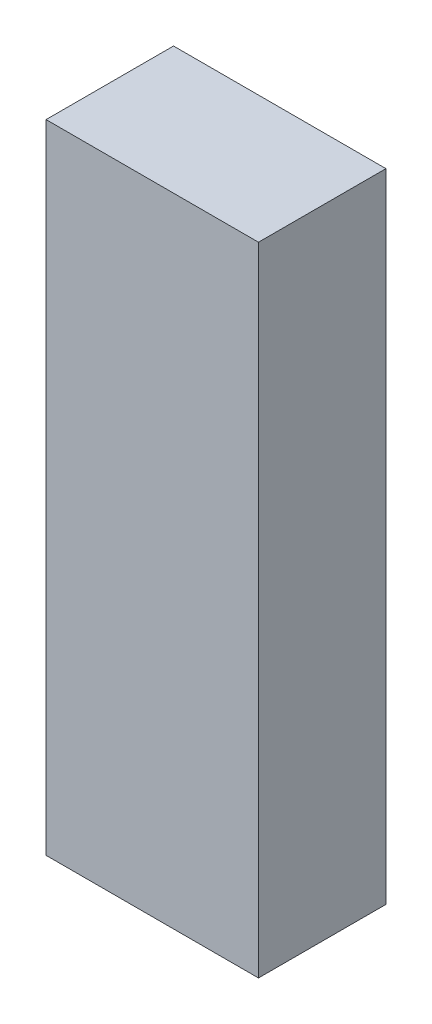
ISO-10303-21;
HEADER;
FILE_DESCRIPTION(('STEP AP214'),'2;1');
FILE_NAME('part.step','',(''),(''),'','','');
FILE_SCHEMA(('AUTOMOTIVE_DESIGN { 1 0 10303 214 1 1 1 1 }'));
ENDSEC;
DATA;
#1=APPLICATION_CONTEXT('core data for automotive mechanical design processes');
#2=APPLICATION_PROTOCOL_DEFINITION('international standard','automotive_design',2000,#1);
#3=PRODUCT_CONTEXT('',#1,'mechanical');
#4=PRODUCT('Part','Part','',(#3));
#5=PRODUCT_RELATED_PRODUCT_CATEGORY('part','',(#4));
#6=PRODUCT_DEFINITION_FORMATION('','',#4);
#7=PRODUCT_DEFINITION_CONTEXT('part definition',#1,'design');
#8=PRODUCT_DEFINITION('design','',#6,#7);
#9=PRODUCT_DEFINITION_SHAPE('','',#8);
#10=(LENGTH_UNIT() NAMED_UNIT(*) SI_UNIT(.MILLI.,.METRE.));
#11=(NAMED_UNIT(*) PLANE_ANGLE_UNIT() SI_UNIT($,.RADIAN.));
#12=(NAMED_UNIT(*) SI_UNIT($,.STERADIAN.) SOLID_ANGLE_UNIT());
#13=UNCERTAINTY_MEASURE_WITH_UNIT(LENGTH_MEASURE(1.E-05),#10,'distance_accuracy_value','');
#14=(GEOMETRIC_REPRESENTATION_CONTEXT(3) GLOBAL_UNCERTAINTY_ASSIGNED_CONTEXT((#13)) GLOBAL_UNIT_ASSIGNED_CONTEXT((#10,
#11,#12)) REPRESENTATION_CONTEXT('',''));
#15=CARTESIAN_POINT('',(0.,0.,0.));
#16=DIRECTION('',(0.,0.,1.));
#17=DIRECTION('',(1.,0.,0.));
#18=AXIS2_PLACEMENT_3D('',#15,#16,#17);
#19=CARTESIAN_POINT('',(-313.749186861166,0.,24.));
#20=DIRECTION('',(1.,0.,0.));
#21=DIRECTION('',(0.,0.,-1.));
#22=AXIS2_PLACEMENT_3D('',#19,#20,#21);
#23=PLANE('',#22);
#24=DIRECTION('',(0.,-1.,0.));
#25=VECTOR('',#24,1.);
#26=CARTESIAN_POINT('',(-313.749186861166,0.,0.));
#27=LINE('',#26,#25);
#28=CARTESIAN_POINT('',(-313.749186861166,120.,0.));
#29=VERTEX_POINT('',#28);
#30=CARTESIAN_POINT('',(-313.749186861166,0.,0.));
#31=VERTEX_POINT('',#30);
#32=EDGE_CURVE('E96',#29,#31,#27,.T.);
#33=ORIENTED_EDGE('',*,*,#32,.T.);
#34=DIRECTION('',(0.,0.,-1.));
#35=VECTOR('',#34,1.);
#36=CARTESIAN_POINT('',(-313.749186861166,0.,24.));
#37=LINE('',#36,#35);
#38=CARTESIAN_POINT('',(-313.749186861166,0.,24.));
#39=VERTEX_POINT('',#38);
#40=EDGE_CURVE('E11',#39,#31,#37,.T.);
#41=ORIENTED_EDGE('',*,*,#40,.F.);
#42=DIRECTION('',(0.,-1.,0.));
#43=VECTOR('',#42,1.);
#44=CARTESIAN_POINT('',(-313.749186861166,0.,24.));
#45=LINE('',#44,#43);
#46=CARTESIAN_POINT('',(-313.749186861166,120.,24.));
#47=VERTEX_POINT('',#46);
#48=EDGE_CURVE('E84',#47,#39,#45,.T.);
#49=ORIENTED_EDGE('',*,*,#48,.F.);
#50=DIRECTION('',(0.,0.,-1.));
#51=VECTOR('',#50,1.);
#52=CARTESIAN_POINT('',(-313.749186861166,120.,24.));
#53=LINE('',#52,#51);
#54=EDGE_CURVE('E92',#47,#29,#53,.T.);
#55=ORIENTED_EDGE('',*,*,#54,.T.);
#56=EDGE_LOOP('',(#33,#41,#49,#55));
#57=FACE_BOUND('',#56,.T.);
#58=ADVANCED_FACE('F33',(#57),#23,.F.);
#59=CARTESIAN_POINT('',(-313.749186861166,0.,24.));
#60=DIRECTION('',(0.,1.,0.));
#61=DIRECTION('',(0.,0.,1.));
#62=AXIS2_PLACEMENT_3D('',#59,#60,#61);
#63=PLANE('',#62);
#64=DIRECTION('',(1.,0.,0.));
#65=VECTOR('',#64,1.);
#66=CARTESIAN_POINT('',(-313.749186861166,0.,0.));
#67=LINE('',#66,#65);
#68=CARTESIAN_POINT('',(-273.749186861166,0.,0.));
#69=VERTEX_POINT('',#68);
#70=EDGE_CURVE('E88',#31,#69,#67,.T.);
#71=ORIENTED_EDGE('',*,*,#70,.T.);
#72=DIRECTION('',(0.,0.,-1.));
#73=VECTOR('',#72,1.);
#74=CARTESIAN_POINT('',(-273.749186861166,0.,24.));
#75=LINE('',#74,#73);
#76=CARTESIAN_POINT('',(-273.749186861166,0.,24.));
#77=VERTEX_POINT('',#76);
#78=EDGE_CURVE('E41',#77,#69,#75,.T.);
#79=ORIENTED_EDGE('',*,*,#78,.F.);
#80=DIRECTION('',(1.,0.,0.));
#81=VECTOR('',#80,1.);
#82=CARTESIAN_POINT('',(-313.749186861166,0.,24.));
#83=LINE('',#82,#81);
#84=EDGE_CURVE('E79',#39,#77,#83,.T.);
#85=ORIENTED_EDGE('',*,*,#84,.F.);
#86=ORIENTED_EDGE('',*,*,#40,.T.);
#87=EDGE_LOOP('',(#71,#79,#85,#86));
#88=FACE_BOUND('',#87,.T.);
#89=ADVANCED_FACE('F87',(#88),#63,.F.);
#90=CARTESIAN_POINT('',(-273.749186861166,0.,24.));
#91=DIRECTION('',(-1.,0.,0.));
#92=DIRECTION('',(0.,0.,1.));
#93=AXIS2_PLACEMENT_3D('',#90,#91,#92);
#94=PLANE('',#93);
#95=DIRECTION('',(0.,1.,0.));
#96=VECTOR('',#95,1.);
#97=CARTESIAN_POINT('',(-273.749186861166,0.,0.));
#98=LINE('',#97,#96);
#99=CARTESIAN_POINT('',(-273.749186861166,120.,0.));
#100=VERTEX_POINT('',#99);
#101=EDGE_CURVE('E66',#69,#100,#98,.T.);
#102=ORIENTED_EDGE('',*,*,#101,.T.);
#103=DIRECTION('',(0.,0.,-1.));
#104=VECTOR('',#103,1.);
#105=CARTESIAN_POINT('',(-273.749186861166,120.,24.));
#106=LINE('',#105,#104);
#107=CARTESIAN_POINT('',(-273.749186861166,120.,24.));
#108=VERTEX_POINT('',#107);
#109=EDGE_CURVE('E89',#108,#100,#106,.T.);
#110=ORIENTED_EDGE('',*,*,#109,.F.);
#111=DIRECTION('',(0.,1.,0.));
#112=VECTOR('',#111,1.);
#113=CARTESIAN_POINT('',(-273.749186861166,0.,24.));
#114=LINE('',#113,#112);
#115=EDGE_CURVE('E82',#77,#108,#114,.T.);
#116=ORIENTED_EDGE('',*,*,#115,.F.);
#117=ORIENTED_EDGE('',*,*,#78,.T.);
#118=EDGE_LOOP('',(#102,#110,#116,#117));
#119=FACE_BOUND('',#118,.T.);
#120=ADVANCED_FACE('F90',(#119),#94,.F.);
#121=CARTESIAN_POINT('',(-313.749186861166,120.,24.));
#122=DIRECTION('',(0.,-1.,0.));
#123=DIRECTION('',(0.,0.,-1.));
#124=AXIS2_PLACEMENT_3D('',#121,#122,#123);
#125=PLANE('',#124);
#126=DIRECTION('',(-1.,0.,0.));
#127=VECTOR('',#126,1.);
#128=CARTESIAN_POINT('',(-313.749186861166,120.,0.));
#129=LINE('',#128,#127);
#130=EDGE_CURVE('E72',#100,#29,#129,.T.);
#131=ORIENTED_EDGE('',*,*,#130,.T.);
#132=ORIENTED_EDGE('',*,*,#54,.F.);
#133=DIRECTION('',(-1.,0.,0.));
#134=VECTOR('',#133,1.);
#135=CARTESIAN_POINT('',(-313.749186861166,120.,24.));
#136=LINE('',#135,#134);
#137=EDGE_CURVE('E49',#108,#47,#136,.T.);
#138=ORIENTED_EDGE('',*,*,#137,.F.);
#139=ORIENTED_EDGE('',*,*,#109,.T.);
#140=EDGE_LOOP('',(#131,#132,#138,#139));
#141=FACE_BOUND('',#140,.T.);
#142=ADVANCED_FACE('F103',(#141),#125,.F.);
#143=CARTESIAN_POINT('',(0.,0.,24.));
#144=DIRECTION('',(0.,0.,-1.));
#145=DIRECTION('',(-1.,0.,0.));
#146=AXIS2_PLACEMENT_3D('',#143,#144,#145);
#147=PLANE('',#146);
#148=ORIENTED_EDGE('',*,*,#48,.T.);
#149=ORIENTED_EDGE('',*,*,#84,.T.);
#150=ORIENTED_EDGE('',*,*,#115,.T.);
#151=ORIENTED_EDGE('',*,*,#137,.T.);
#152=EDGE_LOOP('',(#148,#149,#150,#151));
#153=FACE_BOUND('',#152,.T.);
#154=ADVANCED_FACE('F80',(#153),#147,.F.);
#155=CARTESIAN_POINT('',(0.,0.,0.));
#156=DIRECTION('',(0.,0.,-1.));
#157=DIRECTION('',(-1.,0.,0.));
#158=AXIS2_PLACEMENT_3D('',#155,#156,#157);
#159=PLANE('',#158);
#160=ORIENTED_EDGE('',*,*,#32,.F.);
#161=ORIENTED_EDGE('',*,*,#130,.F.);
#162=ORIENTED_EDGE('',*,*,#101,.F.);
#163=ORIENTED_EDGE('',*,*,#70,.F.);
#164=EDGE_LOOP('',(#160,#161,#162,#163));
#165=FACE_BOUND('',#164,.T.);
#166=ADVANCED_FACE('F106',(#165),#159,.T.);
#167=CLOSED_SHELL('',(#58,#89,#120,#142,#154,#166));
#168=MANIFOLD_SOLID_BREP('B2',#167);
#169=ADVANCED_BREP_SHAPE_REPRESENTATION('',(#18,#168),#14);
#170=SHAPE_DEFINITION_REPRESENTATION(#9,#169);
ENDSEC;
END-ISO-10303-21;
